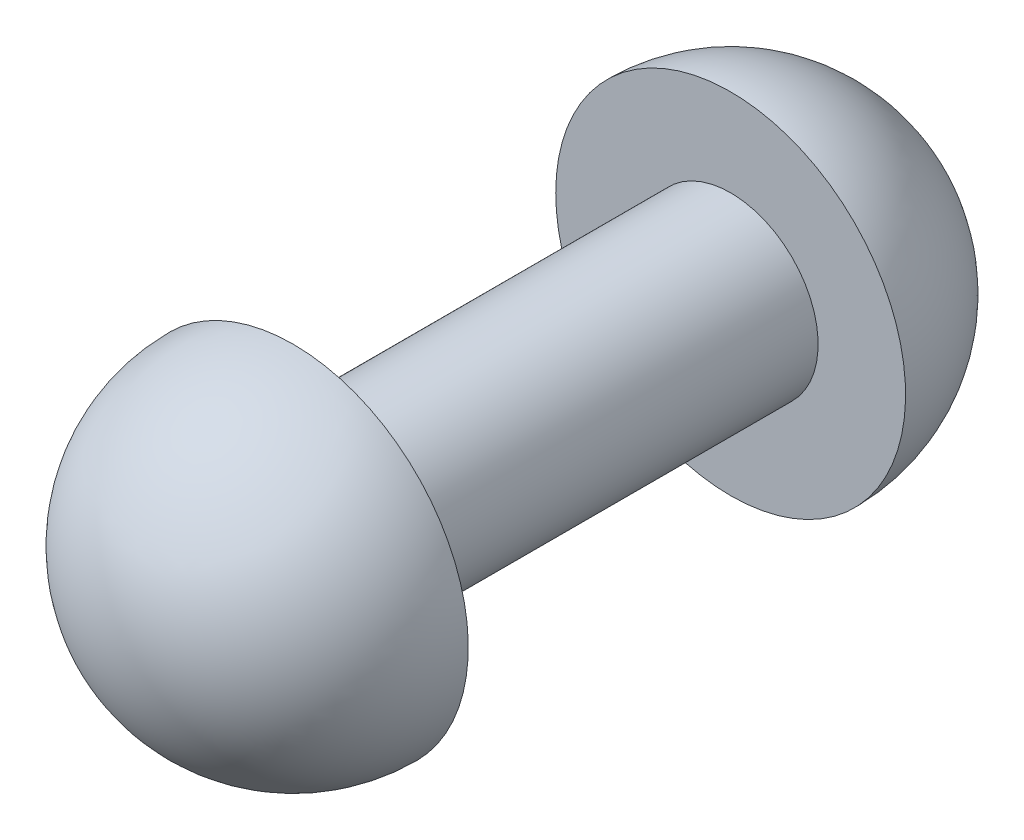
ISO-10303-21;
HEADER;
FILE_DESCRIPTION(('STEP AP214'),'2;1');
FILE_NAME('part.step','',(''),(''),'','','');
FILE_SCHEMA(('AUTOMOTIVE_DESIGN { 1 0 10303 214 1 1 1 1 }'));
ENDSEC;
DATA;
#1=APPLICATION_CONTEXT('core data for automotive mechanical design processes');
#2=APPLICATION_PROTOCOL_DEFINITION('international standard','automotive_design',2000,#1);
#3=PRODUCT_CONTEXT('',#1,'mechanical');
#4=PRODUCT('Part','Part','',(#3));
#5=PRODUCT_RELATED_PRODUCT_CATEGORY('part','',(#4));
#6=PRODUCT_DEFINITION_FORMATION('','',#4);
#7=PRODUCT_DEFINITION_CONTEXT('part definition',#1,'design');
#8=PRODUCT_DEFINITION('design','',#6,#7);
#9=PRODUCT_DEFINITION_SHAPE('','',#8);
#10=(LENGTH_UNIT() NAMED_UNIT(*) SI_UNIT(.MILLI.,.METRE.));
#11=(NAMED_UNIT(*) PLANE_ANGLE_UNIT() SI_UNIT($,.RADIAN.));
#12=(NAMED_UNIT(*) SI_UNIT($,.STERADIAN.) SOLID_ANGLE_UNIT());
#13=UNCERTAINTY_MEASURE_WITH_UNIT(LENGTH_MEASURE(1.E-05),#10,'distance_accuracy_value','');
#14=(GEOMETRIC_REPRESENTATION_CONTEXT(3) GLOBAL_UNCERTAINTY_ASSIGNED_CONTEXT((#13)) GLOBAL_UNIT_ASSIGNED_CONTEXT((#10,
#11,#12)) REPRESENTATION_CONTEXT('',''));
#15=CARTESIAN_POINT('',(0.,0.,0.));
#16=DIRECTION('',(0.,0.,1.));
#17=DIRECTION('',(1.,0.,0.));
#18=AXIS2_PLACEMENT_3D('',#15,#16,#17);
#19=CARTESIAN_POINT('',(0.,3.,-7.5));
#20=DIRECTION('',(0.,0.,1.));
#21=DIRECTION('',(1.,0.,0.));
#22=AXIS2_PLACEMENT_3D('',#19,#20,#21);
#23=PLANE('',#22);
#24=CARTESIAN_POINT('',(0.,0.,-7.5));
#25=DIRECTION('',(0.,0.,-1.));
#26=DIRECTION('',(-1.,0.,0.));
#27=AXIS2_PLACEMENT_3D('',#24,#25,#26);
#28=CIRCLE('',#27,3.);
#29=CARTESIAN_POINT('',(-3.,0.,-7.5));
#30=VERTEX_POINT('',#29);
#31=EDGE_CURVE('E49',#30,#30,#28,.T.);
#32=ORIENTED_EDGE('',*,*,#31,.T.);
#33=EDGE_LOOP('',(#32));
#34=FACE_BOUND('',#33,.T.);
#35=CARTESIAN_POINT('',(0.,0.,-7.5));
#36=DIRECTION('',(0.,0.,-1.));
#37=DIRECTION('',(-1.,0.,0.));
#38=AXIS2_PLACEMENT_3D('',#35,#36,#37);
#39=CIRCLE('',#38,6.);
#40=CARTESIAN_POINT('',(-6.,0.,-7.5));
#41=VERTEX_POINT('',#40);
#42=EDGE_CURVE('E10',#41,#41,#39,.T.);
#43=ORIENTED_EDGE('',*,*,#42,.F.);
#44=EDGE_LOOP('',(#43));
#45=FACE_BOUND('',#44,.T.);
#46=ADVANCED_FACE('F35',(#34,#45),#23,.T.);
#47=CARTESIAN_POINT('',(0.,0.,-7.5));
#48=DIRECTION('',(0.,0.,-1.));
#49=DIRECTION('',(0.,-1.,0.));
#50=AXIS2_PLACEMENT_3D('',#47,#48,#49);
#51=SPHERICAL_SURFACE('',#50,6.);
#52=ORIENTED_EDGE('',*,*,#42,.T.);
#53=EDGE_LOOP('',(#52));
#54=FACE_BOUND('',#53,.T.);
#55=ADVANCED_FACE('F68',(#54),#51,.T.);
#56=CARTESIAN_POINT('',(0.,0.,7.5));
#57=DIRECTION('',(0.,0.,-1.));
#58=DIRECTION('',(0.,1.,0.));
#59=AXIS2_PLACEMENT_3D('',#56,#57,#58);
#60=SPHERICAL_SURFACE('',#59,6.);
#61=CARTESIAN_POINT('',(0.,0.,7.5));
#62=DIRECTION('',(0.,0.,-1.));
#63=DIRECTION('',(-1.,0.,0.));
#64=AXIS2_PLACEMENT_3D('',#61,#62,#63);
#65=CIRCLE('',#64,6.);
#66=CARTESIAN_POINT('',(-6.,0.,7.5));
#67=VERTEX_POINT('',#66);
#68=EDGE_CURVE('E41',#67,#67,#65,.T.);
#69=ORIENTED_EDGE('',*,*,#68,.F.);
#70=EDGE_LOOP('',(#69));
#71=FACE_BOUND('',#70,.T.);
#72=ADVANCED_FACE('F65',(#71),#60,.T.);
#73=CARTESIAN_POINT('',(0.,3.,7.5));
#74=DIRECTION('',(0.,0.,-1.));
#75=DIRECTION('',(-1.,0.,0.));
#76=AXIS2_PLACEMENT_3D('',#73,#74,#75);
#77=PLANE('',#76);
#78=ORIENTED_EDGE('',*,*,#68,.T.);
#79=EDGE_LOOP('',(#78));
#80=FACE_BOUND('',#79,.T.);
#81=CARTESIAN_POINT('',(0.,0.,7.5));
#82=DIRECTION('',(0.,0.,-1.));
#83=DIRECTION('',(-1.,0.,0.));
#84=AXIS2_PLACEMENT_3D('',#81,#82,#83);
#85=CIRCLE('',#84,3.);
#86=CARTESIAN_POINT('',(-3.,0.,7.5));
#87=VERTEX_POINT('',#86);
#88=EDGE_CURVE('E45',#87,#87,#85,.T.);
#89=ORIENTED_EDGE('',*,*,#88,.F.);
#90=EDGE_LOOP('',(#89));
#91=FACE_BOUND('',#90,.T.);
#92=ADVANCED_FACE('F59',(#80,#91),#77,.T.);
#93=CARTESIAN_POINT('',(0.,0.,-17.85));
#94=DIRECTION('',(0.,0.,-1.));
#95=DIRECTION('',(-1.,0.,0.));
#96=AXIS2_PLACEMENT_3D('',#93,#94,#95);
#97=CYLINDRICAL_SURFACE('',#96,3.);
#98=ORIENTED_EDGE('',*,*,#88,.T.);
#99=EDGE_LOOP('',(#98));
#100=FACE_BOUND('',#99,.T.);
#101=ORIENTED_EDGE('',*,*,#31,.F.);
#102=EDGE_LOOP('',(#101));
#103=FACE_BOUND('',#102,.T.);
#104=ADVANCED_FACE('F57',(#100,#103),#97,.T.);
#105=CLOSED_SHELL('',(#46,#55,#72,#92,#104));
#106=MANIFOLD_SOLID_BREP('B2',#105);
#107=ADVANCED_BREP_SHAPE_REPRESENTATION('',(#18,#106),#14);
#108=SHAPE_DEFINITION_REPRESENTATION(#9,#107);
ENDSEC;
END-ISO-10303-21;
